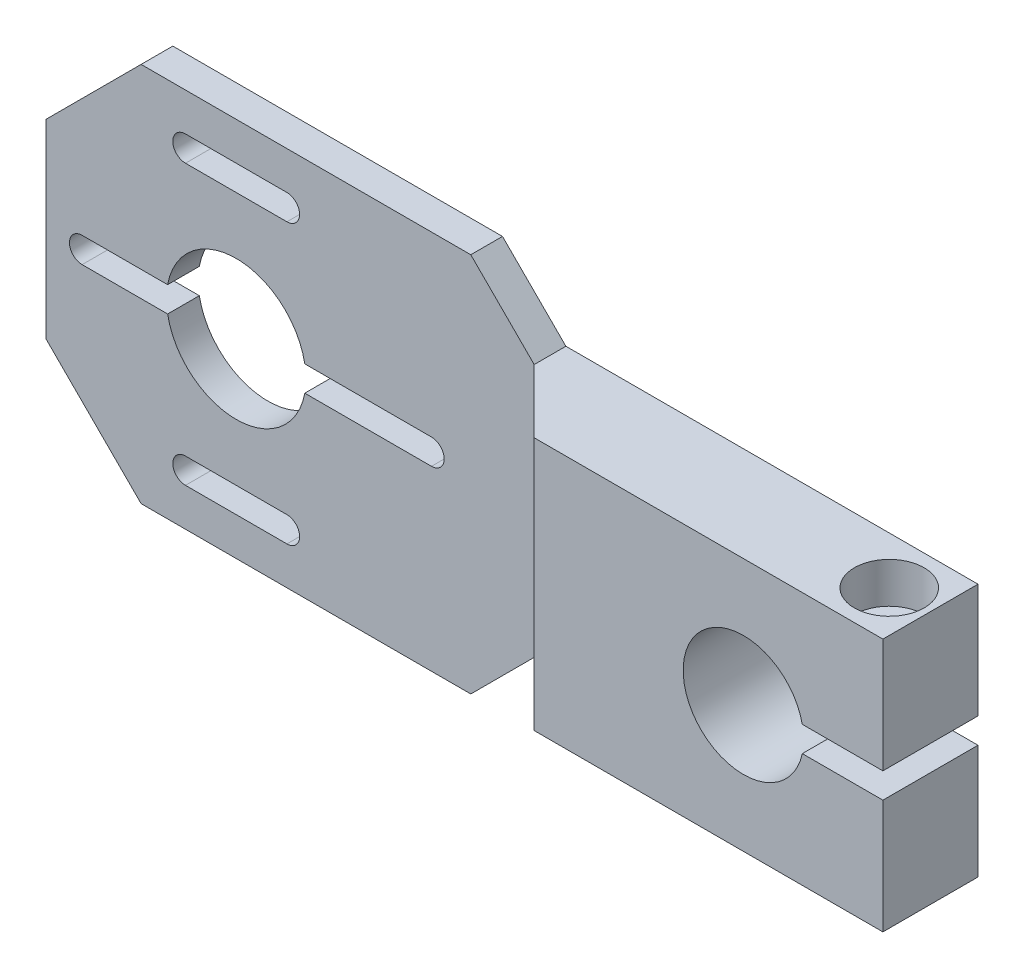
ISO-10303-21;
HEADER;
FILE_DESCRIPTION(('STEP AP214'),'2;1');
FILE_NAME('part.step','',(''),(''),'','','');
FILE_SCHEMA(('AUTOMOTIVE_DESIGN { 1 0 10303 214 1 1 1 1 }'));
ENDSEC;
DATA;
#1=APPLICATION_CONTEXT('core data for automotive mechanical design processes');
#2=APPLICATION_PROTOCOL_DEFINITION('international standard','automotive_design',2000,#1);
#3=PRODUCT_CONTEXT('',#1,'mechanical');
#4=PRODUCT('Part','Part','',(#3));
#5=PRODUCT_RELATED_PRODUCT_CATEGORY('part','',(#4));
#6=PRODUCT_DEFINITION_FORMATION('','',#4);
#7=PRODUCT_DEFINITION_CONTEXT('part definition',#1,'design');
#8=PRODUCT_DEFINITION('design','',#6,#7);
#9=PRODUCT_DEFINITION_SHAPE('','',#8);
#10=(LENGTH_UNIT() NAMED_UNIT(*) SI_UNIT(.MILLI.,.METRE.));
#11=(NAMED_UNIT(*) PLANE_ANGLE_UNIT() SI_UNIT($,.RADIAN.));
#12=(NAMED_UNIT(*) SI_UNIT($,.STERADIAN.) SOLID_ANGLE_UNIT());
#13=UNCERTAINTY_MEASURE_WITH_UNIT(LENGTH_MEASURE(1.E-05),#10,'distance_accuracy_value','');
#14=(GEOMETRIC_REPRESENTATION_CONTEXT(3) GLOBAL_UNCERTAINTY_ASSIGNED_CONTEXT((#13)) GLOBAL_UNIT_ASSIGNED_CONTEXT((#10,
#11,#12)) REPRESENTATION_CONTEXT('',''));
#15=CARTESIAN_POINT('',(0.,0.,0.));
#16=DIRECTION('',(0.,0.,1.));
#17=DIRECTION('',(1.,0.,0.));
#18=AXIS2_PLACEMENT_3D('',#15,#16,#17);
#19=CARTESIAN_POINT('',(0.,0.,15.));
#20=DIRECTION('',(0.,0.,-1.));
#21=DIRECTION('',(-1.,0.,0.));
#22=AXIS2_PLACEMENT_3D('',#19,#20,#21);
#23=CYLINDRICAL_SURFACE('',#22,11.);
#24=DIRECTION('',(0.,0.,-1.));
#25=VECTOR('',#24,1.);
#26=CARTESIAN_POINT('',(10.816653826392,2.,15.));
#27=LINE('',#26,#25);
#28=CARTESIAN_POINT('',(10.816653826392,2.,4.99999999999999));
#29=VERTEX_POINT('',#28);
#30=CARTESIAN_POINT('',(10.816653826392,2.,0.));
#31=VERTEX_POINT('',#30);
#32=EDGE_CURVE('E280',#29,#31,#27,.T.);
#33=ORIENTED_EDGE('',*,*,#32,.F.);
#34=CARTESIAN_POINT('',(0.,0.,4.99999999999999));
#35=DIRECTION('',(0.,0.,1.));
#36=DIRECTION('',(1.,0.,0.));
#37=AXIS2_PLACEMENT_3D('',#34,#35,#36);
#38=CIRCLE('',#37,11.);
#39=CARTESIAN_POINT('',(-10.816653826392,2.,4.99999999999999));
#40=VERTEX_POINT('',#39);
#41=EDGE_CURVE('E334',#29,#40,#38,.T.);
#42=ORIENTED_EDGE('',*,*,#41,.T.);
#43=DIRECTION('',(0.,0.,-1.));
#44=VECTOR('',#43,1.);
#45=CARTESIAN_POINT('',(-10.816653826392,2.,15.));
#46=LINE('',#45,#44);
#47=CARTESIAN_POINT('',(-10.816653826392,2.,0.));
#48=VERTEX_POINT('',#47);
#49=EDGE_CURVE('E299',#48,#40,#46,.F.);
#50=ORIENTED_EDGE('',*,*,#49,.F.);
#51=CARTESIAN_POINT('',(0.,0.,0.));
#52=DIRECTION('',(0.,0.,1.));
#53=DIRECTION('',(1.,0.,0.));
#54=AXIS2_PLACEMENT_3D('',#51,#52,#53);
#55=CIRCLE('',#54,11.);
#56=EDGE_CURVE('E405',#31,#48,#55,.T.);
#57=ORIENTED_EDGE('',*,*,#56,.F.);
#58=EDGE_LOOP('',(#33,#42,#50,#57));
#59=FACE_BOUND('',#58,.T.);
#60=ADVANCED_FACE('F46',(#59),#23,.F.);
#61=CARTESIAN_POINT('',(90.,0.,15.));
#62=DIRECTION('',(0.,0.,1.));
#63=DIRECTION('',(1.,0.,0.));
#64=AXIS2_PLACEMENT_3D('',#61,#62,#63);
#65=PLANE('',#64);
#66=DIRECTION('',(-1.,0.,0.));
#67=VECTOR('',#66,1.);
#68=CARTESIAN_POINT('',(112.,20.,15.));
#69=LINE('',#68,#67);
#70=CARTESIAN_POINT('',(112.,20.,15.));
#71=VERTEX_POINT('',#70);
#72=CARTESIAN_POINT('',(57.,20.,15.));
#73=VERTEX_POINT('',#72);
#74=EDGE_CURVE('E421',#71,#73,#69,.T.);
#75=ORIENTED_EDGE('',*,*,#74,.T.);
#76=DIRECTION('',(0.,-1.,0.));
#77=VECTOR('',#76,1.);
#78=CARTESIAN_POINT('',(57.,0.,15.));
#79=LINE('',#78,#77);
#80=CARTESIAN_POINT('',(57.,-20.,15.));
#81=VERTEX_POINT('',#80);
#82=EDGE_CURVE('E348',#73,#81,#79,.T.);
#83=ORIENTED_EDGE('',*,*,#82,.T.);
#84=DIRECTION('',(1.,0.,0.));
#85=VECTOR('',#84,1.);
#86=CARTESIAN_POINT('',(112.,-20.,15.));
#87=LINE('',#86,#85);
#88=CARTESIAN_POINT('',(112.,-20.,15.));
#89=VERTEX_POINT('',#88);
#90=EDGE_CURVE('E408',#81,#89,#87,.T.);
#91=ORIENTED_EDGE('',*,*,#90,.T.);
#92=DIRECTION('',(0.,1.,0.));
#93=VECTOR('',#92,1.);
#94=CARTESIAN_POINT('',(112.,-20.,15.));
#95=LINE('',#94,#93);
#96=CARTESIAN_POINT('',(112.,-2.,15.));
#97=VERTEX_POINT('',#96);
#98=EDGE_CURVE('E410',#89,#97,#95,.T.);
#99=ORIENTED_EDGE('',*,*,#98,.T.);
#100=DIRECTION('',(-1.,0.,0.));
#101=VECTOR('',#100,1.);
#102=CARTESIAN_POINT('',(112.,-2.,15.));
#103=LINE('',#102,#101);
#104=CARTESIAN_POINT('',(99.2870878105034,-2.,15.));
#105=VERTEX_POINT('',#104);
#106=EDGE_CURVE('E413',#97,#105,#103,.T.);
#107=ORIENTED_EDGE('',*,*,#106,.T.);
#108=CARTESIAN_POINT('',(90.,0.,15.));
#109=DIRECTION('',(0.,0.,-1.));
#110=DIRECTION('',(1.,0.,0.));
#111=AXIS2_PLACEMENT_3D('',#108,#109,#110);
#112=CIRCLE('',#111,9.5);
#113=CARTESIAN_POINT('',(99.2870878105034,2.,15.));
#114=VERTEX_POINT('',#113);
#115=EDGE_CURVE('E415',#105,#114,#112,.T.);
#116=ORIENTED_EDGE('',*,*,#115,.T.);
#117=DIRECTION('',(1.,0.,0.));
#118=VECTOR('',#117,1.);
#119=CARTESIAN_POINT('',(112.,2.,15.));
#120=LINE('',#119,#118);
#121=CARTESIAN_POINT('',(112.,2.,15.));
#122=VERTEX_POINT('',#121);
#123=EDGE_CURVE('E417',#114,#122,#120,.T.);
#124=ORIENTED_EDGE('',*,*,#123,.T.);
#125=DIRECTION('',(0.,1.,0.));
#126=VECTOR('',#125,1.);
#127=CARTESIAN_POINT('',(112.,20.,15.));
#128=LINE('',#127,#126);
#129=EDGE_CURVE('E419',#122,#71,#128,.T.);
#130=ORIENTED_EDGE('',*,*,#129,.T.);
#131=EDGE_LOOP('',(#75,#83,#91,#99,#107,#116,#124,#130));
#132=FACE_BOUND('',#131,.T.);
#133=ADVANCED_FACE('F535',(#132),#65,.T.);
#134=CARTESIAN_POINT('',(36.9999999999998,30.,15.));
#135=DIRECTION('',(0.,-1.,0.));
#136=DIRECTION('',(0.,0.,-1.));
#137=AXIS2_PLACEMENT_3D('',#134,#135,#136);
#138=PLANE('',#137);
#139=DIRECTION('',(-1.,0.,0.));
#140=VECTOR('',#139,1.);
#141=CARTESIAN_POINT('',(36.9999999999998,30.,4.99999999999999));
#142=LINE('',#141,#140);
#143=CARTESIAN_POINT('',(36.9999999999998,30.,4.99999999999999));
#144=VERTEX_POINT('',#143);
#145=CARTESIAN_POINT('',(-15.,30.,4.99999999999999));
#146=VERTEX_POINT('',#145);
#147=EDGE_CURVE('E340',#144,#146,#142,.T.);
#148=ORIENTED_EDGE('',*,*,#147,.F.);
#149=DIRECTION('',(0.,0.,-1.));
#150=VECTOR('',#149,1.);
#151=CARTESIAN_POINT('',(36.9999999999998,30.,15.));
#152=LINE('',#151,#150);
#153=CARTESIAN_POINT('',(36.9999999999998,30.,0.));
#154=VERTEX_POINT('',#153);
#155=EDGE_CURVE('E424',#144,#154,#152,.T.);
#156=ORIENTED_EDGE('',*,*,#155,.T.);
#157=DIRECTION('',(-1.,0.,0.));
#158=VECTOR('',#157,1.);
#159=CARTESIAN_POINT('',(36.9999999999998,30.,0.));
#160=LINE('',#159,#158);
#161=CARTESIAN_POINT('',(-15.,30.,0.));
#162=VERTEX_POINT('',#161);
#163=EDGE_CURVE('E407',#154,#162,#160,.T.);
#164=ORIENTED_EDGE('',*,*,#163,.T.);
#165=DIRECTION('',(0.,0.,-1.));
#166=VECTOR('',#165,1.);
#167=CARTESIAN_POINT('',(-15.,30.,15.));
#168=LINE('',#167,#166);
#169=EDGE_CURVE('E490',#146,#162,#168,.T.);
#170=ORIENTED_EDGE('',*,*,#169,.F.);
#171=EDGE_LOOP('',(#148,#156,#164,#170));
#172=FACE_BOUND('',#171,.T.);
#173=ADVANCED_FACE('F48',(#172),#138,.F.);
#174=CARTESIAN_POINT('',(-15.,30.,15.));
#175=DIRECTION('',(0.707106781186547,-0.707106781186548,0.));
#176=DIRECTION('',(0.707106781186548,0.707106781186547,0.));
#177=AXIS2_PLACEMENT_3D('',#174,#175,#176);
#178=PLANE('',#177);
#179=DIRECTION('',(-0.707106781186548,-0.707106781186547,0.));
#180=VECTOR('',#179,1.);
#181=CARTESIAN_POINT('',(-15.,30.,4.99999999999999));
#182=LINE('',#181,#180);
#183=CARTESIAN_POINT('',(-30.,15.,5.));
#184=VERTEX_POINT('',#183);
#185=EDGE_CURVE('E342',#146,#184,#182,.T.);
#186=ORIENTED_EDGE('',*,*,#185,.F.);
#187=ORIENTED_EDGE('',*,*,#169,.T.);
#188=DIRECTION('',(-0.707106781186548,-0.707106781186547,0.));
#189=VECTOR('',#188,1.);
#190=CARTESIAN_POINT('',(-15.,30.,0.));
#191=LINE('',#190,#189);
#192=CARTESIAN_POINT('',(-30.,15.,0.));
#193=VERTEX_POINT('',#192);
#194=EDGE_CURVE('E427',#162,#193,#191,.T.);
#195=ORIENTED_EDGE('',*,*,#194,.T.);
#196=DIRECTION('',(0.,0.,-1.));
#197=VECTOR('',#196,1.);
#198=CARTESIAN_POINT('',(-30.,15.,15.));
#199=LINE('',#198,#197);
#200=EDGE_CURVE('E488',#184,#193,#199,.T.);
#201=ORIENTED_EDGE('',*,*,#200,.F.);
#202=EDGE_LOOP('',(#186,#187,#195,#201));
#203=FACE_BOUND('',#202,.T.);
#204=ADVANCED_FACE('F690',(#203),#178,.F.);
#205=CARTESIAN_POINT('',(-30.,15.,15.));
#206=DIRECTION('',(1.,0.,0.));
#207=DIRECTION('',(0.,1.,0.));
#208=AXIS2_PLACEMENT_3D('',#205,#206,#207);
#209=PLANE('',#208);
#210=DIRECTION('',(0.,1.,0.));
#211=VECTOR('',#210,1.);
#212=CARTESIAN_POINT('',(-30.,-30.0000000000001,5.));
#213=LINE('',#212,#211);
#214=CARTESIAN_POINT('',(-30.,-15.,4.99999999999999));
#215=VERTEX_POINT('',#214);
#216=EDGE_CURVE('E309',#215,#184,#213,.T.);
#217=ORIENTED_EDGE('',*,*,#216,.T.);
#218=ORIENTED_EDGE('',*,*,#200,.T.);
#219=DIRECTION('',(0.,-1.,0.));
#220=VECTOR('',#219,1.);
#221=CARTESIAN_POINT('',(-30.,15.,0.));
#222=LINE('',#221,#220);
#223=CARTESIAN_POINT('',(-30.,-15.,0.));
#224=VERTEX_POINT('',#223);
#225=EDGE_CURVE('E430',#193,#224,#222,.T.);
#226=ORIENTED_EDGE('',*,*,#225,.T.);
#227=DIRECTION('',(0.,0.,-1.));
#228=VECTOR('',#227,1.);
#229=CARTESIAN_POINT('',(-30.,-15.,15.));
#230=LINE('',#229,#228);
#231=EDGE_CURVE('E486',#215,#224,#230,.T.);
#232=ORIENTED_EDGE('',*,*,#231,.F.);
#233=EDGE_LOOP('',(#217,#218,#226,#232));
#234=FACE_BOUND('',#233,.T.);
#235=ADVANCED_FACE('F686',(#234),#209,.F.);
#236=CARTESIAN_POINT('',(-30.,-15.,15.));
#237=DIRECTION('',(0.707106781186547,0.707106781186548,0.));
#238=DIRECTION('',(-0.707106781186548,0.707106781186547,0.));
#239=AXIS2_PLACEMENT_3D('',#236,#237,#238);
#240=PLANE('',#239);
#241=DIRECTION('',(0.707106781186548,-0.707106781186547,0.));
#242=VECTOR('',#241,1.);
#243=CARTESIAN_POINT('',(-30.,-15.,4.99999999999999));
#244=LINE('',#243,#242);
#245=CARTESIAN_POINT('',(-15.,-30.,4.99999999999999));
#246=VERTEX_POINT('',#245);
#247=EDGE_CURVE('E346',#215,#246,#244,.T.);
#248=ORIENTED_EDGE('',*,*,#247,.F.);
#249=ORIENTED_EDGE('',*,*,#231,.T.);
#250=DIRECTION('',(0.707106781186548,-0.707106781186547,0.));
#251=VECTOR('',#250,1.);
#252=CARTESIAN_POINT('',(-30.,-15.,0.));
#253=LINE('',#252,#251);
#254=CARTESIAN_POINT('',(-15.,-30.,0.));
#255=VERTEX_POINT('',#254);
#256=EDGE_CURVE('E433',#224,#255,#253,.T.);
#257=ORIENTED_EDGE('',*,*,#256,.T.);
#258=DIRECTION('',(0.,0.,-1.));
#259=VECTOR('',#258,1.);
#260=CARTESIAN_POINT('',(-15.,-30.,15.));
#261=LINE('',#260,#259);
#262=EDGE_CURVE('E484',#246,#255,#261,.T.);
#263=ORIENTED_EDGE('',*,*,#262,.F.);
#264=EDGE_LOOP('',(#248,#249,#257,#263));
#265=FACE_BOUND('',#264,.T.);
#266=ADVANCED_FACE('F683',(#265),#240,.F.);
#267=CARTESIAN_POINT('',(-15.,-30.,15.));
#268=DIRECTION('',(0.,1.,0.));
#269=DIRECTION('',(-1.,0.,0.));
#270=AXIS2_PLACEMENT_3D('',#267,#268,#269);
#271=PLANE('',#270);
#272=DIRECTION('',(1.,0.,0.));
#273=VECTOR('',#272,1.);
#274=CARTESIAN_POINT('',(0.,-30.,4.99999999999999));
#275=LINE('',#274,#273);
#276=CARTESIAN_POINT('',(36.9999999999998,-30.,4.99999999999999));
#277=VERTEX_POINT('',#276);
#278=EDGE_CURVE('E306',#246,#277,#275,.T.);
#279=ORIENTED_EDGE('',*,*,#278,.F.);
#280=ORIENTED_EDGE('',*,*,#262,.T.);
#281=DIRECTION('',(1.,0.,0.));
#282=VECTOR('',#281,1.);
#283=CARTESIAN_POINT('',(-15.,-30.,0.));
#284=LINE('',#283,#282);
#285=CARTESIAN_POINT('',(36.9999999999998,-30.,0.));
#286=VERTEX_POINT('',#285);
#287=EDGE_CURVE('E436',#255,#286,#284,.T.);
#288=ORIENTED_EDGE('',*,*,#287,.T.);
#289=DIRECTION('',(0.,0.,-1.));
#290=VECTOR('',#289,1.);
#291=CARTESIAN_POINT('',(36.9999999999998,-30.,15.));
#292=LINE('',#291,#290);
#293=EDGE_CURVE('E482',#277,#286,#292,.T.);
#294=ORIENTED_EDGE('',*,*,#293,.F.);
#295=EDGE_LOOP('',(#279,#280,#288,#294));
#296=FACE_BOUND('',#295,.T.);
#297=ADVANCED_FACE('F679',(#296),#271,.F.);
#298=CARTESIAN_POINT('',(36.9999999999998,-30.,15.));
#299=DIRECTION('',(-0.707106781186543,0.707106781186552,0.));
#300=DIRECTION('',(-0.707106781186552,-0.707106781186543,0.));
#301=AXIS2_PLACEMENT_3D('',#298,#299,#300);
#302=PLANE('',#301);
#303=DIRECTION('',(0.707106781186552,0.707106781186543,0.));
#304=VECTOR('',#303,1.);
#305=CARTESIAN_POINT('',(36.9999999999998,-30.,4.99999999999999));
#306=LINE('',#305,#304);
#307=CARTESIAN_POINT('',(47.,-20.,4.99999999999999));
#308=VERTEX_POINT('',#307);
#309=EDGE_CURVE('E344',#277,#308,#306,.T.);
#310=ORIENTED_EDGE('',*,*,#309,.F.);
#311=ORIENTED_EDGE('',*,*,#293,.T.);
#312=DIRECTION('',(0.707106781186552,0.707106781186543,0.));
#313=VECTOR('',#312,1.);
#314=CARTESIAN_POINT('',(36.9999999999998,-30.,0.));
#315=LINE('',#314,#313);
#316=CARTESIAN_POINT('',(47.,-20.,0.));
#317=VERTEX_POINT('',#316);
#318=EDGE_CURVE('E439',#286,#317,#315,.T.);
#319=ORIENTED_EDGE('',*,*,#318,.T.);
#320=DIRECTION('',(0.,0.,-1.));
#321=VECTOR('',#320,1.);
#322=CARTESIAN_POINT('',(47.,-20.,15.));
#323=LINE('',#322,#321);
#324=EDGE_CURVE('E480',#308,#317,#323,.T.);
#325=ORIENTED_EDGE('',*,*,#324,.F.);
#326=EDGE_LOOP('',(#310,#311,#319,#325));
#327=FACE_BOUND('',#326,.T.);
#328=ADVANCED_FACE('F675',(#327),#302,.F.);
#329=CARTESIAN_POINT('',(112.,-20.,15.));
#330=DIRECTION('',(0.,1.,0.));
#331=DIRECTION('',(-1.,0.,0.));
#332=AXIS2_PLACEMENT_3D('',#329,#330,#331);
#333=PLANE('',#332);
#334=CARTESIAN_POINT('',(105.5,-20.,7.5));
#335=DIRECTION('',(0.,1.,0.));
#336=DIRECTION('',(-1.,0.,0.));
#337=AXIS2_PLACEMENT_3D('',#334,#335,#336);
#338=CIRCLE('',#337,2.5);
#339=CARTESIAN_POINT('',(103.,-20.,7.5));
#340=VERTEX_POINT('',#339);
#341=EDGE_CURVE('E305',#340,#340,#338,.T.);
#342=ORIENTED_EDGE('',*,*,#341,.T.);
#343=EDGE_LOOP('',(#342));
#344=FACE_BOUND('',#343,.T.);
#345=DIRECTION('',(0.707106781186546,0.,0.707106781186549));
#346=VECTOR('',#345,1.);
#347=CARTESIAN_POINT('',(84.4999999999999,-20.,42.5));
#348=LINE('',#347,#346);
#349=EDGE_CURVE('E351',#308,#81,#348,.T.);
#350=ORIENTED_EDGE('',*,*,#349,.F.);
#351=ORIENTED_EDGE('',*,*,#324,.T.);
#352=DIRECTION('',(1.,0.,0.));
#353=VECTOR('',#352,1.);
#354=CARTESIAN_POINT('',(112.,-20.,0.));
#355=LINE('',#354,#353);
#356=CARTESIAN_POINT('',(112.,-20.,0.));
#357=VERTEX_POINT('',#356);
#358=EDGE_CURVE('E442',#317,#357,#355,.T.);
#359=ORIENTED_EDGE('',*,*,#358,.T.);
#360=DIRECTION('',(0.,0.,-1.));
#361=VECTOR('',#360,1.);
#362=CARTESIAN_POINT('',(112.,-20.,15.));
#363=LINE('',#362,#361);
#364=EDGE_CURVE('E477',#89,#357,#363,.T.);
#365=ORIENTED_EDGE('',*,*,#364,.F.);
#366=ORIENTED_EDGE('',*,*,#90,.F.);
#367=EDGE_LOOP('',(#350,#351,#359,#365,#366));
#368=FACE_BOUND('',#367,.T.);
#369=ADVANCED_FACE('F668',(#344,#368),#333,.F.);
#370=CARTESIAN_POINT('',(112.,20.,15.));
#371=DIRECTION('',(0.,-1.,0.));
#372=DIRECTION('',(1.,0.,0.));
#373=AXIS2_PLACEMENT_3D('',#370,#371,#372);
#374=PLANE('',#373);
#375=CARTESIAN_POINT('',(105.5,20.,7.5));
#376=DIRECTION('',(0.,1.,0.));
#377=DIRECTION('',(0.,0.,1.));
#378=AXIS2_PLACEMENT_3D('',#375,#376,#377);
#379=CIRCLE('',#378,5.49999999999999);
#380=CARTESIAN_POINT('',(105.5,20.,13.));
#381=VERTEX_POINT('',#380);
#382=EDGE_CURVE('E353',#381,#381,#379,.T.);
#383=ORIENTED_EDGE('',*,*,#382,.F.);
#384=EDGE_LOOP('',(#383));
#385=FACE_BOUND('',#384,.T.);
#386=DIRECTION('',(-0.707106781186546,0.,-0.707106781186549));
#387=VECTOR('',#386,1.);
#388=CARTESIAN_POINT('',(84.4999999999999,20.,42.5));
#389=LINE('',#388,#387);
#390=CARTESIAN_POINT('',(47.,20.,4.99999999999998));
#391=VERTEX_POINT('',#390);
#392=EDGE_CURVE('E495',#73,#391,#389,.T.);
#393=ORIENTED_EDGE('',*,*,#392,.F.);
#394=ORIENTED_EDGE('',*,*,#74,.F.);
#395=DIRECTION('',(0.,0.,-1.));
#396=VECTOR('',#395,1.);
#397=CARTESIAN_POINT('',(112.,20.,15.));
#398=LINE('',#397,#396);
#399=CARTESIAN_POINT('',(112.,20.,0.));
#400=VERTEX_POINT('',#399);
#401=EDGE_CURVE('E462',#71,#400,#398,.T.);
#402=ORIENTED_EDGE('',*,*,#401,.T.);
#403=DIRECTION('',(-1.,0.,0.));
#404=VECTOR('',#403,1.);
#405=CARTESIAN_POINT('',(112.,20.,0.));
#406=LINE('',#405,#404);
#407=CARTESIAN_POINT('',(47.,20.,0.));
#408=VERTEX_POINT('',#407);
#409=EDGE_CURVE('E454',#400,#408,#406,.T.);
#410=ORIENTED_EDGE('',*,*,#409,.T.);
#411=DIRECTION('',(0.,0.,-1.));
#412=VECTOR('',#411,1.);
#413=CARTESIAN_POINT('',(47.,20.,15.));
#414=LINE('',#413,#412);
#415=EDGE_CURVE('E460',#391,#408,#414,.T.);
#416=ORIENTED_EDGE('',*,*,#415,.F.);
#417=EDGE_LOOP('',(#393,#394,#402,#410,#416));
#418=FACE_BOUND('',#417,.T.);
#419=ADVANCED_FACE('F530',(#385,#418),#374,.F.);
#420=CARTESIAN_POINT('',(36.9999999999998,30.,15.));
#421=DIRECTION('',(-0.707106781186543,-0.707106781186552,0.));
#422=DIRECTION('',(0.707106781186552,-0.707106781186543,0.));
#423=AXIS2_PLACEMENT_3D('',#420,#421,#422);
#424=PLANE('',#423);
#425=DIRECTION('',(-0.707106781186552,0.707106781186543,0.));
#426=VECTOR('',#425,1.);
#427=CARTESIAN_POINT('',(36.9999999999998,30.,4.99999999999999));
#428=LINE('',#427,#426);
#429=EDGE_CURVE('E338',#391,#144,#428,.T.);
#430=ORIENTED_EDGE('',*,*,#429,.F.);
#431=ORIENTED_EDGE('',*,*,#415,.T.);
#432=DIRECTION('',(-0.707106781186552,0.707106781186543,0.));
#433=VECTOR('',#432,1.);
#434=CARTESIAN_POINT('',(36.9999999999998,30.,0.));
#435=LINE('',#434,#433);
#436=EDGE_CURVE('E411',#408,#154,#435,.T.);
#437=ORIENTED_EDGE('',*,*,#436,.T.);
#438=ORIENTED_EDGE('',*,*,#155,.F.);
#439=EDGE_LOOP('',(#430,#431,#437,#438));
#440=FACE_BOUND('',#439,.T.);
#441=ADVANCED_FACE('F521',(#440),#424,.F.);
#442=DIRECTION('',(0.,0.,-1.));
#443=VECTOR('',#442,1.);
#444=CARTESIAN_POINT('',(10.816653826392,-2.,15.));
#445=LINE('',#444,#443);
#446=CARTESIAN_POINT('',(10.816653826392,-2.,0.));
#447=VERTEX_POINT('',#446);
#448=CARTESIAN_POINT('',(10.816653826392,-2.,4.99999999999999));
#449=VERTEX_POINT('',#448);
#450=EDGE_CURVE('E60',#447,#449,#445,.F.);
#451=ORIENTED_EDGE('',*,*,#450,.F.);
#452=CARTESIAN_POINT('',(-10.816653826392,-2.,0.));
#453=VERTEX_POINT('',#452);
#454=EDGE_CURVE('E270',#453,#447,#55,.T.);
#455=ORIENTED_EDGE('',*,*,#454,.F.);
#456=DIRECTION('',(0.,0.,-1.));
#457=VECTOR('',#456,1.);
#458=CARTESIAN_POINT('',(-10.816653826392,-2.,15.));
#459=LINE('',#458,#457);
#460=CARTESIAN_POINT('',(-10.816653826392,-2.,4.99999999999999));
#461=VERTEX_POINT('',#460);
#462=EDGE_CURVE('E296',#461,#453,#459,.T.);
#463=ORIENTED_EDGE('',*,*,#462,.F.);
#464=EDGE_CURVE('E335',#461,#449,#38,.T.);
#465=ORIENTED_EDGE('',*,*,#464,.T.);
#466=EDGE_LOOP('',(#451,#455,#463,#465));
#467=FACE_BOUND('',#466,.T.);
#468=ADVANCED_FACE('F518',(#467),#23,.F.);
#469=CARTESIAN_POINT('',(-8.,22.,15.));
#470=DIRECTION('',(0.,0.,-1.));
#471=DIRECTION('',(-1.,0.,0.));
#472=AXIS2_PLACEMENT_3D('',#469,#470,#471);
#473=CYLINDRICAL_SURFACE('',#472,2.);
#474=DIRECTION('',(0.,0.,-1.));
#475=VECTOR('',#474,1.);
#476=CARTESIAN_POINT('',(-8.,24.,15.));
#477=LINE('',#476,#475);
#478=CARTESIAN_POINT('',(-8.,24.,4.99999999999999));
#479=VERTEX_POINT('',#478);
#480=CARTESIAN_POINT('',(-7.99999999999999,24.,0.));
#481=VERTEX_POINT('',#480);
#482=EDGE_CURVE('E397',#479,#481,#477,.T.);
#483=ORIENTED_EDGE('',*,*,#482,.F.);
#484=CARTESIAN_POINT('',(-8.,22.,4.99999999999999));
#485=DIRECTION('',(0.,0.,1.));
#486=DIRECTION('',(1.,0.,0.));
#487=AXIS2_PLACEMENT_3D('',#484,#485,#486);
#488=CIRCLE('',#487,2.);
#489=CARTESIAN_POINT('',(-8.,20.,4.99999999999999));
#490=VERTEX_POINT('',#489);
#491=EDGE_CURVE('E331',#479,#490,#488,.T.);
#492=ORIENTED_EDGE('',*,*,#491,.T.);
#493=DIRECTION('',(0.,0.,-1.));
#494=VECTOR('',#493,1.);
#495=CARTESIAN_POINT('',(-8.,20.,15.));
#496=LINE('',#495,#494);
#497=CARTESIAN_POINT('',(-8.,20.,0.));
#498=VERTEX_POINT('',#497);
#499=EDGE_CURVE('E403',#490,#498,#496,.T.);
#500=ORIENTED_EDGE('',*,*,#499,.T.);
#501=CARTESIAN_POINT('',(-8.,22.,0.));
#502=DIRECTION('',(0.,0.,1.));
#503=DIRECTION('',(1.,0.,0.));
#504=AXIS2_PLACEMENT_3D('',#501,#502,#503);
#505=CIRCLE('',#504,2.);
#506=EDGE_CURVE('E385',#481,#498,#505,.T.);
#507=ORIENTED_EDGE('',*,*,#506,.F.);
#508=EDGE_LOOP('',(#483,#492,#500,#507));
#509=FACE_BOUND('',#508,.T.);
#510=ADVANCED_FACE('F520',(#509),#473,.F.);
#511=CARTESIAN_POINT('',(-8.,20.,15.));
#512=DIRECTION('',(0.,1.,0.));
#513=DIRECTION('',(0.,0.,1.));
#514=AXIS2_PLACEMENT_3D('',#511,#512,#513);
#515=PLANE('',#514);
#516=ORIENTED_EDGE('',*,*,#499,.F.);
#517=DIRECTION('',(1.,0.,0.));
#518=VECTOR('',#517,1.);
#519=CARTESIAN_POINT('',(-8.,20.,4.99999999999999));
#520=LINE('',#519,#518);
#521=CARTESIAN_POINT('',(8.,20.,4.99999999999999));
#522=VERTEX_POINT('',#521);
#523=EDGE_CURVE('E328',#490,#522,#520,.T.);
#524=ORIENTED_EDGE('',*,*,#523,.T.);
#525=DIRECTION('',(0.,0.,-1.));
#526=VECTOR('',#525,1.);
#527=CARTESIAN_POINT('',(8.,20.,15.));
#528=LINE('',#527,#526);
#529=CARTESIAN_POINT('',(8.,20.,0.));
#530=VERTEX_POINT('',#529);
#531=EDGE_CURVE('E401',#522,#530,#528,.T.);
#532=ORIENTED_EDGE('',*,*,#531,.T.);
#533=DIRECTION('',(1.,0.,0.));
#534=VECTOR('',#533,1.);
#535=CARTESIAN_POINT('',(-8.,20.,0.));
#536=LINE('',#535,#534);
#537=EDGE_CURVE('E388',#498,#530,#536,.T.);
#538=ORIENTED_EDGE('',*,*,#537,.F.);
#539=EDGE_LOOP('',(#516,#524,#532,#538));
#540=FACE_BOUND('',#539,.T.);
#541=ADVANCED_FACE('F527',(#540),#515,.T.);
#542=CARTESIAN_POINT('',(8.,22.,15.));
#543=DIRECTION('',(0.,0.,-1.));
#544=DIRECTION('',(-1.,0.,0.));
#545=AXIS2_PLACEMENT_3D('',#542,#543,#544);
#546=CYLINDRICAL_SURFACE('',#545,2.);
#547=ORIENTED_EDGE('',*,*,#531,.F.);
#548=CARTESIAN_POINT('',(8.,22.,4.99999999999999));
#549=DIRECTION('',(0.,0.,1.));
#550=DIRECTION('',(1.,0.,0.));
#551=AXIS2_PLACEMENT_3D('',#548,#549,#550);
#552=CIRCLE('',#551,2.);
#553=CARTESIAN_POINT('',(8.,24.,4.99999999999999));
#554=VERTEX_POINT('',#553);
#555=EDGE_CURVE('E325',#522,#554,#552,.T.);
#556=ORIENTED_EDGE('',*,*,#555,.T.);
#557=DIRECTION('',(0.,0.,-1.));
#558=VECTOR('',#557,1.);
#559=CARTESIAN_POINT('',(8.,24.,15.));
#560=LINE('',#559,#558);
#561=CARTESIAN_POINT('',(8.,24.,0.));
#562=VERTEX_POINT('',#561);
#563=EDGE_CURVE('E399',#554,#562,#560,.T.);
#564=ORIENTED_EDGE('',*,*,#563,.T.);
#565=CARTESIAN_POINT('',(8.,22.,0.));
#566=DIRECTION('',(0.,0.,1.));
#567=DIRECTION('',(1.,0.,0.));
#568=AXIS2_PLACEMENT_3D('',#565,#566,#567);
#569=CIRCLE('',#568,2.);
#570=EDGE_CURVE('E391',#530,#562,#569,.T.);
#571=ORIENTED_EDGE('',*,*,#570,.F.);
#572=EDGE_LOOP('',(#547,#556,#564,#571));
#573=FACE_BOUND('',#572,.T.);
#574=ADVANCED_FACE('F602',(#573),#546,.F.);
#575=CARTESIAN_POINT('',(-8.,24.,15.));
#576=DIRECTION('',(0.,-1.,0.));
#577=DIRECTION('',(0.,0.,-1.));
#578=AXIS2_PLACEMENT_3D('',#575,#576,#577);
#579=PLANE('',#578);
#580=ORIENTED_EDGE('',*,*,#563,.F.);
#581=DIRECTION('',(-1.,0.,0.));
#582=VECTOR('',#581,1.);
#583=CARTESIAN_POINT('',(-8.,24.,4.99999999999999));
#584=LINE('',#583,#582);
#585=EDGE_CURVE('E322',#554,#479,#584,.T.);
#586=ORIENTED_EDGE('',*,*,#585,.T.);
#587=ORIENTED_EDGE('',*,*,#482,.T.);
#588=DIRECTION('',(-1.,0.,0.));
#589=VECTOR('',#588,1.);
#590=CARTESIAN_POINT('',(-8.,24.,0.));
#591=LINE('',#590,#589);
#592=EDGE_CURVE('E394',#562,#481,#591,.T.);
#593=ORIENTED_EDGE('',*,*,#592,.F.);
#594=EDGE_LOOP('',(#580,#586,#587,#593));
#595=FACE_BOUND('',#594,.T.);
#596=ADVANCED_FACE('F598',(#595),#579,.T.);
#597=CARTESIAN_POINT('',(-8.,-22.,15.));
#598=DIRECTION('',(0.,0.,-1.));
#599=DIRECTION('',(-1.,0.,0.));
#600=AXIS2_PLACEMENT_3D('',#597,#598,#599);
#601=CYLINDRICAL_SURFACE('',#600,2.);
#602=DIRECTION('',(0.,0.,-1.));
#603=VECTOR('',#602,1.);
#604=CARTESIAN_POINT('',(-8.,-20.,15.));
#605=LINE('',#604,#603);
#606=CARTESIAN_POINT('',(-8.,-20.,4.99999999999999));
#607=VERTEX_POINT('',#606);
#608=CARTESIAN_POINT('',(-7.99999999999999,-20.,0.));
#609=VERTEX_POINT('',#608);
#610=EDGE_CURVE('E377',#607,#609,#605,.T.);
#611=ORIENTED_EDGE('',*,*,#610,.F.);
#612=CARTESIAN_POINT('',(-8.,-22.,4.99999999999999));
#613=DIRECTION('',(0.,0.,1.));
#614=DIRECTION('',(1.,0.,0.));
#615=AXIS2_PLACEMENT_3D('',#612,#613,#614);
#616=CIRCLE('',#615,2.);
#617=CARTESIAN_POINT('',(-8.,-24.,4.99999999999999));
#618=VERTEX_POINT('',#617);
#619=EDGE_CURVE('E319',#607,#618,#616,.T.);
#620=ORIENTED_EDGE('',*,*,#619,.T.);
#621=DIRECTION('',(0.,0.,-1.));
#622=VECTOR('',#621,1.);
#623=CARTESIAN_POINT('',(-8.,-24.,15.));
#624=LINE('',#623,#622);
#625=CARTESIAN_POINT('',(-8.,-24.,0.));
#626=VERTEX_POINT('',#625);
#627=EDGE_CURVE('E383',#618,#626,#624,.T.);
#628=ORIENTED_EDGE('',*,*,#627,.T.);
#629=CARTESIAN_POINT('',(-8.,-22.,0.));
#630=DIRECTION('',(0.,0.,1.));
#631=DIRECTION('',(-1.,0.,0.));
#632=AXIS2_PLACEMENT_3D('',#629,#630,#631);
#633=CIRCLE('',#632,2.);
#634=EDGE_CURVE('E365',#609,#626,#633,.T.);
#635=ORIENTED_EDGE('',*,*,#634,.F.);
#636=EDGE_LOOP('',(#611,#620,#628,#635));
#637=FACE_BOUND('',#636,.T.);
#638=ADVANCED_FACE('F594',(#637),#601,.F.);
#639=CARTESIAN_POINT('',(-8.,-24.,15.));
#640=DIRECTION('',(0.,1.,0.));
#641=DIRECTION('',(0.,0.,1.));
#642=AXIS2_PLACEMENT_3D('',#639,#640,#641);
#643=PLANE('',#642);
#644=ORIENTED_EDGE('',*,*,#627,.F.);
#645=DIRECTION('',(1.,0.,0.));
#646=VECTOR('',#645,1.);
#647=CARTESIAN_POINT('',(-8.,-24.,4.99999999999999));
#648=LINE('',#647,#646);
#649=CARTESIAN_POINT('',(8.,-24.,4.99999999999999));
#650=VERTEX_POINT('',#649);
#651=EDGE_CURVE('E316',#618,#650,#648,.T.);
#652=ORIENTED_EDGE('',*,*,#651,.T.);
#653=DIRECTION('',(0.,0.,-1.));
#654=VECTOR('',#653,1.);
#655=CARTESIAN_POINT('',(8.,-24.,15.));
#656=LINE('',#655,#654);
#657=CARTESIAN_POINT('',(8.,-24.,0.));
#658=VERTEX_POINT('',#657);
#659=EDGE_CURVE('E381',#650,#658,#656,.T.);
#660=ORIENTED_EDGE('',*,*,#659,.T.);
#661=DIRECTION('',(1.,0.,0.));
#662=VECTOR('',#661,1.);
#663=CARTESIAN_POINT('',(-8.,-24.,0.));
#664=LINE('',#663,#662);
#665=EDGE_CURVE('E368',#626,#658,#664,.T.);
#666=ORIENTED_EDGE('',*,*,#665,.F.);
#667=EDGE_LOOP('',(#644,#652,#660,#666));
#668=FACE_BOUND('',#667,.T.);
#669=ADVANCED_FACE('F590',(#668),#643,.T.);
#670=CARTESIAN_POINT('',(8.,-22.,15.));
#671=DIRECTION('',(0.,0.,-1.));
#672=DIRECTION('',(-1.,0.,0.));
#673=AXIS2_PLACEMENT_3D('',#670,#671,#672);
#674=CYLINDRICAL_SURFACE('',#673,2.);
#675=ORIENTED_EDGE('',*,*,#659,.F.);
#676=CARTESIAN_POINT('',(8.,-22.,4.99999999999999));
#677=DIRECTION('',(0.,0.,1.));
#678=DIRECTION('',(1.,0.,0.));
#679=AXIS2_PLACEMENT_3D('',#676,#677,#678);
#680=CIRCLE('',#679,2.);
#681=CARTESIAN_POINT('',(8.,-20.,4.99999999999999));
#682=VERTEX_POINT('',#681);
#683=EDGE_CURVE('E312',#650,#682,#680,.T.);
#684=ORIENTED_EDGE('',*,*,#683,.T.);
#685=DIRECTION('',(0.,0.,-1.));
#686=VECTOR('',#685,1.);
#687=CARTESIAN_POINT('',(8.,-20.,15.));
#688=LINE('',#687,#686);
#689=CARTESIAN_POINT('',(8.,-20.,0.));
#690=VERTEX_POINT('',#689);
#691=EDGE_CURVE('E379',#682,#690,#688,.T.);
#692=ORIENTED_EDGE('',*,*,#691,.T.);
#693=CARTESIAN_POINT('',(8.,-22.,0.));
#694=DIRECTION('',(0.,0.,1.));
#695=DIRECTION('',(-1.,0.,0.));
#696=AXIS2_PLACEMENT_3D('',#693,#694,#695);
#697=CIRCLE('',#696,2.);
#698=EDGE_CURVE('E371',#658,#690,#697,.T.);
#699=ORIENTED_EDGE('',*,*,#698,.F.);
#700=EDGE_LOOP('',(#675,#684,#692,#699));
#701=FACE_BOUND('',#700,.T.);
#702=ADVANCED_FACE('F586',(#701),#674,.F.);
#703=CARTESIAN_POINT('',(-8.,-20.,15.));
#704=DIRECTION('',(0.,-1.,0.));
#705=DIRECTION('',(0.,0.,-1.));
#706=AXIS2_PLACEMENT_3D('',#703,#704,#705);
#707=PLANE('',#706);
#708=ORIENTED_EDGE('',*,*,#691,.F.);
#709=DIRECTION('',(-1.,0.,0.));
#710=VECTOR('',#709,1.);
#711=CARTESIAN_POINT('',(-8.,-20.,4.99999999999999));
#712=LINE('',#711,#710);
#713=EDGE_CURVE('E492',#682,#607,#712,.T.);
#714=ORIENTED_EDGE('',*,*,#713,.T.);
#715=ORIENTED_EDGE('',*,*,#610,.T.);
#716=DIRECTION('',(-1.,0.,0.));
#717=VECTOR('',#716,1.);
#718=CARTESIAN_POINT('',(-8.,-20.,0.));
#719=LINE('',#718,#717);
#720=EDGE_CURVE('E374',#690,#609,#719,.T.);
#721=ORIENTED_EDGE('',*,*,#720,.F.);
#722=EDGE_LOOP('',(#708,#714,#715,#721));
#723=FACE_BOUND('',#722,.T.);
#724=ADVANCED_FACE('F583',(#723),#707,.T.);
#725=CARTESIAN_POINT('',(90.,0.,0.));
#726=DIRECTION('',(0.,0.,1.));
#727=DIRECTION('',(1.,0.,0.));
#728=AXIS2_PLACEMENT_3D('',#725,#726,#727);
#729=PLANE('',#728);
#730=ORIENTED_EDGE('',*,*,#506,.T.);
#731=ORIENTED_EDGE('',*,*,#537,.T.);
#732=ORIENTED_EDGE('',*,*,#570,.T.);
#733=ORIENTED_EDGE('',*,*,#592,.T.);
#734=EDGE_LOOP('',(#730,#731,#732,#733));
#735=FACE_BOUND('',#734,.T.);
#736=ORIENTED_EDGE('',*,*,#163,.F.);
#737=ORIENTED_EDGE('',*,*,#436,.F.);
#738=ORIENTED_EDGE('',*,*,#409,.F.);
#739=DIRECTION('',(0.,1.,0.));
#740=VECTOR('',#739,1.);
#741=CARTESIAN_POINT('',(112.,20.,0.));
#742=LINE('',#741,#740);
#743=CARTESIAN_POINT('',(112.,2.,0.));
#744=VERTEX_POINT('',#743);
#745=EDGE_CURVE('E452',#744,#400,#742,.T.);
#746=ORIENTED_EDGE('',*,*,#745,.F.);
#747=DIRECTION('',(1.,0.,0.));
#748=VECTOR('',#747,1.);
#749=CARTESIAN_POINT('',(112.,2.,0.));
#750=LINE('',#749,#748);
#751=CARTESIAN_POINT('',(99.2870878105034,2.,0.));
#752=VERTEX_POINT('',#751);
#753=EDGE_CURVE('E450',#752,#744,#750,.T.);
#754=ORIENTED_EDGE('',*,*,#753,.F.);
#755=CARTESIAN_POINT('',(90.,0.,0.));
#756=DIRECTION('',(0.,0.,-1.));
#757=DIRECTION('',(1.,0.,0.));
#758=AXIS2_PLACEMENT_3D('',#755,#756,#757);
#759=CIRCLE('',#758,9.5);
#760=CARTESIAN_POINT('',(99.2870878105034,-2.,0.));
#761=VERTEX_POINT('',#760);
#762=EDGE_CURVE('E448',#761,#752,#759,.T.);
#763=ORIENTED_EDGE('',*,*,#762,.F.);
#764=DIRECTION('',(-1.,0.,0.));
#765=VECTOR('',#764,1.);
#766=CARTESIAN_POINT('',(112.,-2.,0.));
#767=LINE('',#766,#765);
#768=CARTESIAN_POINT('',(112.,-2.,0.));
#769=VERTEX_POINT('',#768);
#770=EDGE_CURVE('E446',#769,#761,#767,.T.);
#771=ORIENTED_EDGE('',*,*,#770,.F.);
#772=DIRECTION('',(0.,1.,0.));
#773=VECTOR('',#772,1.);
#774=CARTESIAN_POINT('',(112.,-20.,0.));
#775=LINE('',#774,#773);
#776=EDGE_CURVE('E444',#357,#769,#775,.T.);
#777=ORIENTED_EDGE('',*,*,#776,.F.);
#778=ORIENTED_EDGE('',*,*,#358,.F.);
#779=ORIENTED_EDGE('',*,*,#318,.F.);
#780=ORIENTED_EDGE('',*,*,#287,.F.);
#781=ORIENTED_EDGE('',*,*,#256,.F.);
#782=ORIENTED_EDGE('',*,*,#225,.F.);
#783=ORIENTED_EDGE('',*,*,#194,.F.);
#784=EDGE_LOOP('',(#736,#737,#738,#746,#754,#763,#771,#777,#778,#779,#780,#781,#782,#783));
#785=FACE_BOUND('',#784,.T.);
#786=CARTESIAN_POINT('',(30.8,0.,0.));
#787=DIRECTION('',(0.,0.,1.));
#788=DIRECTION('',(1.,0.,0.));
#789=AXIS2_PLACEMENT_3D('',#786,#787,#788);
#790=CIRCLE('',#789,2.);
#791=CARTESIAN_POINT('',(30.8,-2.,0.));
#792=VERTEX_POINT('',#791);
#793=CARTESIAN_POINT('',(30.8,2.,0.));
#794=VERTEX_POINT('',#793);
#795=EDGE_CURVE('E259',#792,#794,#790,.T.);
#796=ORIENTED_EDGE('',*,*,#795,.T.);
#797=DIRECTION('',(-1.,0.,0.));
#798=VECTOR('',#797,1.);
#799=CARTESIAN_POINT('',(8.8,2.,0.));
#800=LINE('',#799,#798);
#801=EDGE_CURVE('E256',#794,#31,#800,.T.);
#802=ORIENTED_EDGE('',*,*,#801,.T.);
#803=ORIENTED_EDGE('',*,*,#56,.T.);
#804=DIRECTION('',(-1.,0.,0.));
#805=VECTOR('',#804,1.);
#806=CARTESIAN_POINT('',(-24.3,2.,0.));
#807=LINE('',#806,#805);
#808=CARTESIAN_POINT('',(-24.3,2.,0.));
#809=VERTEX_POINT('',#808);
#810=EDGE_CURVE('E288',#48,#809,#807,.T.);
#811=ORIENTED_EDGE('',*,*,#810,.T.);
#812=CARTESIAN_POINT('',(-24.3,0.,0.));
#813=DIRECTION('',(0.,0.,1.));
#814=DIRECTION('',(1.,0.,0.));
#815=AXIS2_PLACEMENT_3D('',#812,#813,#814);
#816=CIRCLE('',#815,2.);
#817=CARTESIAN_POINT('',(-24.3,-2.,0.));
#818=VERTEX_POINT('',#817);
#819=EDGE_CURVE('E282',#809,#818,#816,.T.);
#820=ORIENTED_EDGE('',*,*,#819,.T.);
#821=DIRECTION('',(1.,0.,0.));
#822=VECTOR('',#821,1.);
#823=CARTESIAN_POINT('',(-24.3,-2.,0.));
#824=LINE('',#823,#822);
#825=EDGE_CURVE('E285',#818,#453,#824,.T.);
#826=ORIENTED_EDGE('',*,*,#825,.T.);
#827=ORIENTED_EDGE('',*,*,#454,.T.);
#828=DIRECTION('',(1.,0.,0.));
#829=VECTOR('',#828,1.);
#830=CARTESIAN_POINT('',(8.8,-2.,0.));
#831=LINE('',#830,#829);
#832=EDGE_CURVE('E251',#447,#792,#831,.T.);
#833=ORIENTED_EDGE('',*,*,#832,.T.);
#834=EDGE_LOOP('',(#796,#802,#803,#811,#820,#826,#827,#833));
#835=FACE_BOUND('',#834,.T.);
#836=ORIENTED_EDGE('',*,*,#634,.T.);
#837=ORIENTED_EDGE('',*,*,#665,.T.);
#838=ORIENTED_EDGE('',*,*,#698,.T.);
#839=ORIENTED_EDGE('',*,*,#720,.T.);
#840=EDGE_LOOP('',(#836,#837,#838,#839));
#841=FACE_BOUND('',#840,.T.);
#842=ADVANCED_FACE('F266',(#735,#785,#835,#841),#729,.F.);
#843=CARTESIAN_POINT('',(112.,-20.,15.));
#844=DIRECTION('',(-1.,0.,0.));
#845=DIRECTION('',(0.,0.,1.));
#846=AXIS2_PLACEMENT_3D('',#843,#844,#845);
#847=PLANE('',#846);
#848=ORIENTED_EDGE('',*,*,#776,.T.);
#849=DIRECTION('',(0.,0.,-1.));
#850=VECTOR('',#849,1.);
#851=CARTESIAN_POINT('',(112.,-2.,15.));
#852=LINE('',#851,#850);
#853=EDGE_CURVE('E474',#97,#769,#852,.T.);
#854=ORIENTED_EDGE('',*,*,#853,.F.);
#855=ORIENTED_EDGE('',*,*,#98,.F.);
#856=ORIENTED_EDGE('',*,*,#364,.T.);
#857=EDGE_LOOP('',(#848,#854,#855,#856));
#858=FACE_BOUND('',#857,.T.);
#859=ADVANCED_FACE('F624',(#858),#847,.F.);
#860=CARTESIAN_POINT('',(112.,-2.,15.));
#861=DIRECTION('',(0.,-1.,0.));
#862=DIRECTION('',(1.,0.,0.));
#863=AXIS2_PLACEMENT_3D('',#860,#861,#862);
#864=PLANE('',#863);
#865=CARTESIAN_POINT('',(105.5,-2.,7.5));
#866=DIRECTION('',(0.,1.,0.));
#867=DIRECTION('',(0.,0.,1.));
#868=AXIS2_PLACEMENT_3D('',#865,#866,#867);
#869=CIRCLE('',#868,2.5);
#870=CARTESIAN_POINT('',(105.5,-2.,10.));
#871=VERTEX_POINT('',#870);
#872=EDGE_CURVE('E302',#871,#871,#869,.T.);
#873=ORIENTED_EDGE('',*,*,#872,.F.);
#874=EDGE_LOOP('',(#873));
#875=FACE_BOUND('',#874,.T.);
#876=ORIENTED_EDGE('',*,*,#770,.T.);
#877=DIRECTION('',(0.,0.,-1.));
#878=VECTOR('',#877,1.);
#879=CARTESIAN_POINT('',(99.2870878105034,-2.,15.));
#880=LINE('',#879,#878);
#881=EDGE_CURVE('E471',#105,#761,#880,.T.);
#882=ORIENTED_EDGE('',*,*,#881,.F.);
#883=ORIENTED_EDGE('',*,*,#106,.F.);
#884=ORIENTED_EDGE('',*,*,#853,.T.);
#885=EDGE_LOOP('',(#876,#882,#883,#884));
#886=FACE_BOUND('',#885,.T.);
#887=ADVANCED_FACE('F659',(#875,#886),#864,.F.);
#888=CARTESIAN_POINT('',(90.,0.,15.));
#889=DIRECTION('',(0.,0.,-1.));
#890=DIRECTION('',(-1.,0.,0.));
#891=AXIS2_PLACEMENT_3D('',#888,#889,#890);
#892=CYLINDRICAL_SURFACE('',#891,9.5);
#893=ORIENTED_EDGE('',*,*,#762,.T.);
#894=DIRECTION('',(0.,0.,-1.));
#895=VECTOR('',#894,1.);
#896=CARTESIAN_POINT('',(99.2870878105034,2.,15.));
#897=LINE('',#896,#895);
#898=EDGE_CURVE('E468',#114,#752,#897,.T.);
#899=ORIENTED_EDGE('',*,*,#898,.F.);
#900=ORIENTED_EDGE('',*,*,#115,.F.);
#901=ORIENTED_EDGE('',*,*,#881,.T.);
#902=EDGE_LOOP('',(#893,#899,#900,#901));
#903=FACE_BOUND('',#902,.T.);
#904=ADVANCED_FACE('F653',(#903),#892,.F.);
#905=CARTESIAN_POINT('',(112.,2.,15.));
#906=DIRECTION('',(0.,1.,0.));
#907=DIRECTION('',(-1.,0.,0.));
#908=AXIS2_PLACEMENT_3D('',#905,#906,#907);
#909=PLANE('',#908);
#910=CARTESIAN_POINT('',(105.5,2.,7.5));
#911=DIRECTION('',(0.,1.,0.));
#912=DIRECTION('',(-1.,0.,0.));
#913=AXIS2_PLACEMENT_3D('',#910,#911,#912);
#914=CIRCLE('',#913,3.3);
#915=CARTESIAN_POINT('',(102.2,2.,7.5));
#916=VERTEX_POINT('',#915);
#917=EDGE_CURVE('E362',#916,#916,#914,.T.);
#918=ORIENTED_EDGE('',*,*,#917,.T.);
#919=EDGE_LOOP('',(#918));
#920=FACE_BOUND('',#919,.T.);
#921=ORIENTED_EDGE('',*,*,#753,.T.);
#922=DIRECTION('',(0.,0.,-1.));
#923=VECTOR('',#922,1.);
#924=CARTESIAN_POINT('',(112.,2.,15.));
#925=LINE('',#924,#923);
#926=EDGE_CURVE('E465',#122,#744,#925,.T.);
#927=ORIENTED_EDGE('',*,*,#926,.F.);
#928=ORIENTED_EDGE('',*,*,#123,.F.);
#929=ORIENTED_EDGE('',*,*,#898,.T.);
#930=EDGE_LOOP('',(#921,#927,#928,#929));
#931=FACE_BOUND('',#930,.T.);
#932=ADVANCED_FACE('F649',(#920,#931),#909,.F.);
#933=CARTESIAN_POINT('',(112.,20.,15.));
#934=DIRECTION('',(-1.,0.,0.));
#935=DIRECTION('',(0.,0.,1.));
#936=AXIS2_PLACEMENT_3D('',#933,#934,#935);
#937=PLANE('',#936);
#938=ORIENTED_EDGE('',*,*,#745,.T.);
#939=ORIENTED_EDGE('',*,*,#401,.F.);
#940=ORIENTED_EDGE('',*,*,#129,.F.);
#941=ORIENTED_EDGE('',*,*,#926,.T.);
#942=EDGE_LOOP('',(#938,#939,#940,#941));
#943=FACE_BOUND('',#942,.T.);
#944=ADVANCED_FACE('F581',(#943),#937,.F.);
#945=CARTESIAN_POINT('',(105.5,20.,7.5));
#946=DIRECTION('',(0.,1.,0.));
#947=DIRECTION('',(0.,0.,1.));
#948=AXIS2_PLACEMENT_3D('',#945,#946,#947);
#949=CYLINDRICAL_SURFACE('',#948,3.3);
#950=ORIENTED_EDGE('',*,*,#917,.F.);
#951=EDGE_LOOP('',(#950));
#952=FACE_BOUND('',#951,.T.);
#953=CARTESIAN_POINT('',(105.5,13.6,7.5));
#954=DIRECTION('',(0.,1.,0.));
#955=DIRECTION('',(0.,0.,1.));
#956=AXIS2_PLACEMENT_3D('',#953,#954,#955);
#957=CIRCLE('',#956,3.30000000000001);
#958=CARTESIAN_POINT('',(105.5,13.6,10.8));
#959=VERTEX_POINT('',#958);
#960=EDGE_CURVE('E359',#959,#959,#957,.T.);
#961=ORIENTED_EDGE('',*,*,#960,.T.);
#962=EDGE_LOOP('',(#961));
#963=FACE_BOUND('',#962,.T.);
#964=ADVANCED_FACE('F577',(#952,#963),#949,.F.);
#965=CARTESIAN_POINT('',(108.8,13.6,7.5));
#966=DIRECTION('',(0.,-1.,0.));
#967=DIRECTION('',(0.,0.,-1.));
#968=AXIS2_PLACEMENT_3D('',#965,#966,#967);
#969=PLANE('',#968);
#970=ORIENTED_EDGE('',*,*,#960,.F.);
#971=EDGE_LOOP('',(#970));
#972=FACE_BOUND('',#971,.T.);
#973=CARTESIAN_POINT('',(105.5,13.6,7.5));
#974=DIRECTION('',(0.,1.,0.));
#975=DIRECTION('',(0.,0.,1.));
#976=AXIS2_PLACEMENT_3D('',#973,#974,#975);
#977=CIRCLE('',#976,5.49999999999999);
#978=CARTESIAN_POINT('',(105.5,13.6,13.));
#979=VERTEX_POINT('',#978);
#980=EDGE_CURVE('E356',#979,#979,#977,.T.);
#981=ORIENTED_EDGE('',*,*,#980,.T.);
#982=EDGE_LOOP('',(#981));
#983=FACE_BOUND('',#982,.T.);
#984=ADVANCED_FACE('F573',(#972,#983),#969,.F.);
#985=CARTESIAN_POINT('',(105.5,20.,7.5));
#986=DIRECTION('',(0.,1.,0.));
#987=DIRECTION('',(0.,0.,1.));
#988=AXIS2_PLACEMENT_3D('',#985,#986,#987);
#989=CYLINDRICAL_SURFACE('',#988,5.49999999999999);
#990=ORIENTED_EDGE('',*,*,#980,.F.);
#991=EDGE_LOOP('',(#990));
#992=FACE_BOUND('',#991,.T.);
#993=ORIENTED_EDGE('',*,*,#382,.T.);
#994=EDGE_LOOP('',(#993));
#995=FACE_BOUND('',#994,.T.);
#996=ADVANCED_FACE('F569',(#992,#995),#989,.F.);
#997=CARTESIAN_POINT('',(21.0000000000001,-30.,-21.));
#998=DIRECTION('',(-0.707106781186549,0.,0.707106781186546));
#999=DIRECTION('',(0.707106781186546,0.,0.707106781186549));
#1000=AXIS2_PLACEMENT_3D('',#997,#998,#999);
#1001=PLANE('',#1000);
#1002=ORIENTED_EDGE('',*,*,#349,.T.);
#1003=ORIENTED_EDGE('',*,*,#82,.F.);
#1004=ORIENTED_EDGE('',*,*,#392,.T.);
#1005=DIRECTION('',(0.,1.,0.));
#1006=VECTOR('',#1005,1.);
#1007=CARTESIAN_POINT('',(47.,-30.,4.99999999999999));
#1008=LINE('',#1007,#1006);
#1009=EDGE_CURVE('E308',#308,#391,#1008,.T.);
#1010=ORIENTED_EDGE('',*,*,#1009,.F.);
#1011=EDGE_LOOP('',(#1002,#1003,#1004,#1010));
#1012=FACE_BOUND('',#1011,.T.);
#1013=ADVANCED_FACE('F566',(#1012),#1001,.T.);
#1014=CARTESIAN_POINT('',(0.,-30.,4.99999999999999));
#1015=DIRECTION('',(0.,0.,1.));
#1016=DIRECTION('',(1.,0.,0.));
#1017=AXIS2_PLACEMENT_3D('',#1014,#1015,#1016);
#1018=PLANE('',#1017);
#1019=DIRECTION('',(-1.,0.,0.));
#1020=VECTOR('',#1019,1.);
#1021=CARTESIAN_POINT('',(8.8,2.,4.99999999999999));
#1022=LINE('',#1021,#1020);
#1023=CARTESIAN_POINT('',(30.8,2.,4.99999999999999));
#1024=VERTEX_POINT('',#1023);
#1025=EDGE_CURVE('E271',#1024,#29,#1022,.T.);
#1026=ORIENTED_EDGE('',*,*,#1025,.F.);
#1027=CARTESIAN_POINT('',(30.8,0.,4.99999999999999));
#1028=DIRECTION('',(0.,0.,1.));
#1029=DIRECTION('',(1.,0.,0.));
#1030=AXIS2_PLACEMENT_3D('',#1027,#1028,#1029);
#1031=CIRCLE('',#1030,2.);
#1032=CARTESIAN_POINT('',(30.8,-2.,4.99999999999999));
#1033=VERTEX_POINT('',#1032);
#1034=EDGE_CURVE('E273',#1033,#1024,#1031,.T.);
#1035=ORIENTED_EDGE('',*,*,#1034,.F.);
#1036=DIRECTION('',(1.,0.,0.));
#1037=VECTOR('',#1036,1.);
#1038=CARTESIAN_POINT('',(0.,-2.,4.99999999999999));
#1039=LINE('',#1038,#1037);
#1040=EDGE_CURVE('E13',#449,#1033,#1039,.T.);
#1041=ORIENTED_EDGE('',*,*,#1040,.F.);
#1042=ORIENTED_EDGE('',*,*,#464,.F.);
#1043=DIRECTION('',(1.,0.,0.));
#1044=VECTOR('',#1043,1.);
#1045=CARTESIAN_POINT('',(-24.3,-2.,4.99999999999999));
#1046=LINE('',#1045,#1044);
#1047=CARTESIAN_POINT('',(-24.3,-2.,4.99999999999999));
#1048=VERTEX_POINT('',#1047);
#1049=EDGE_CURVE('E286',#1048,#461,#1046,.T.);
#1050=ORIENTED_EDGE('',*,*,#1049,.F.);
#1051=CARTESIAN_POINT('',(-24.3,0.,4.99999999999999));
#1052=DIRECTION('',(0.,0.,1.));
#1053=DIRECTION('',(1.,0.,0.));
#1054=AXIS2_PLACEMENT_3D('',#1051,#1052,#1053);
#1055=CIRCLE('',#1054,2.);
#1056=CARTESIAN_POINT('',(-24.3,2.,4.99999999999999));
#1057=VERTEX_POINT('',#1056);
#1058=EDGE_CURVE('E68',#1057,#1048,#1055,.T.);
#1059=ORIENTED_EDGE('',*,*,#1058,.F.);
#1060=DIRECTION('',(-1.,0.,0.));
#1061=VECTOR('',#1060,1.);
#1062=CARTESIAN_POINT('',(0.,2.,4.99999999999999));
#1063=LINE('',#1062,#1061);
#1064=EDGE_CURVE('E54',#40,#1057,#1063,.T.);
#1065=ORIENTED_EDGE('',*,*,#1064,.F.);
#1066=ORIENTED_EDGE('',*,*,#41,.F.);
#1067=EDGE_LOOP('',(#1026,#1035,#1041,#1042,#1050,#1059,#1065,#1066));
#1068=FACE_BOUND('',#1067,.T.);
#1069=ORIENTED_EDGE('',*,*,#713,.F.);
#1070=ORIENTED_EDGE('',*,*,#683,.F.);
#1071=ORIENTED_EDGE('',*,*,#651,.F.);
#1072=ORIENTED_EDGE('',*,*,#619,.F.);
#1073=EDGE_LOOP('',(#1069,#1070,#1071,#1072));
#1074=FACE_BOUND('',#1073,.T.);
#1075=ORIENTED_EDGE('',*,*,#585,.F.);
#1076=ORIENTED_EDGE('',*,*,#555,.F.);
#1077=ORIENTED_EDGE('',*,*,#523,.F.);
#1078=ORIENTED_EDGE('',*,*,#491,.F.);
#1079=EDGE_LOOP('',(#1075,#1076,#1077,#1078));
#1080=FACE_BOUND('',#1079,.T.);
#1081=ORIENTED_EDGE('',*,*,#247,.T.);
#1082=ORIENTED_EDGE('',*,*,#278,.T.);
#1083=ORIENTED_EDGE('',*,*,#309,.T.);
#1084=ORIENTED_EDGE('',*,*,#1009,.T.);
#1085=ORIENTED_EDGE('',*,*,#429,.T.);
#1086=ORIENTED_EDGE('',*,*,#147,.T.);
#1087=ORIENTED_EDGE('',*,*,#185,.T.);
#1088=ORIENTED_EDGE('',*,*,#216,.F.);
#1089=EDGE_LOOP('',(#1081,#1082,#1083,#1084,#1085,#1086,#1087,#1088));
#1090=FACE_BOUND('',#1089,.T.);
#1091=ADVANCED_FACE('F510',(#1068,#1074,#1080,#1090),#1018,.T.);
#1092=CARTESIAN_POINT('',(105.5,-2.,7.5));
#1093=DIRECTION('',(0.,1.,0.));
#1094=DIRECTION('',(0.,0.,1.));
#1095=AXIS2_PLACEMENT_3D('',#1092,#1093,#1094);
#1096=CYLINDRICAL_SURFACE('',#1095,2.5);
#1097=ORIENTED_EDGE('',*,*,#872,.T.);
#1098=EDGE_LOOP('',(#1097));
#1099=FACE_BOUND('',#1098,.T.);
#1100=ORIENTED_EDGE('',*,*,#341,.F.);
#1101=EDGE_LOOP('',(#1100));
#1102=FACE_BOUND('',#1101,.T.);
#1103=ADVANCED_FACE('F560',(#1099,#1102),#1096,.F.);
#1104=CARTESIAN_POINT('',(-24.3,0.,0.));
#1105=DIRECTION('',(0.,0.,1.));
#1106=DIRECTION('',(1.,0.,0.));
#1107=AXIS2_PLACEMENT_3D('',#1104,#1105,#1106);
#1108=CYLINDRICAL_SURFACE('',#1107,2.);
#1109=ORIENTED_EDGE('',*,*,#1058,.T.);
#1110=DIRECTION('',(0.,0.,1.));
#1111=VECTOR('',#1110,1.);
#1112=CARTESIAN_POINT('',(-24.3,-2.,0.));
#1113=LINE('',#1112,#1111);
#1114=EDGE_CURVE('E291',#818,#1048,#1113,.T.);
#1115=ORIENTED_EDGE('',*,*,#1114,.F.);
#1116=ORIENTED_EDGE('',*,*,#819,.F.);
#1117=DIRECTION('',(0.,0.,1.));
#1118=VECTOR('',#1117,1.);
#1119=CARTESIAN_POINT('',(-24.3,2.,0.));
#1120=LINE('',#1119,#1118);
#1121=EDGE_CURVE('E294',#809,#1057,#1120,.T.);
#1122=ORIENTED_EDGE('',*,*,#1121,.T.);
#1123=EDGE_LOOP('',(#1109,#1115,#1116,#1122));
#1124=FACE_BOUND('',#1123,.T.);
#1125=ADVANCED_FACE('F507',(#1124),#1108,.F.);
#1126=CARTESIAN_POINT('',(-24.3,2.,0.));
#1127=DIRECTION('',(0.,1.,0.));
#1128=DIRECTION('',(-1.,0.,0.));
#1129=AXIS2_PLACEMENT_3D('',#1126,#1127,#1128);
#1130=PLANE('',#1129);
#1131=ORIENTED_EDGE('',*,*,#49,.T.);
#1132=ORIENTED_EDGE('',*,*,#1064,.T.);
#1133=ORIENTED_EDGE('',*,*,#1121,.F.);
#1134=ORIENTED_EDGE('',*,*,#810,.F.);
#1135=EDGE_LOOP('',(#1131,#1132,#1133,#1134));
#1136=FACE_BOUND('',#1135,.T.);
#1137=ADVANCED_FACE('F501',(#1136),#1130,.F.);
#1138=CARTESIAN_POINT('',(-24.3,-2.,0.));
#1139=DIRECTION('',(0.,-1.,0.));
#1140=DIRECTION('',(1.,0.,0.));
#1141=AXIS2_PLACEMENT_3D('',#1138,#1139,#1140);
#1142=PLANE('',#1141);
#1143=ORIENTED_EDGE('',*,*,#462,.T.);
#1144=ORIENTED_EDGE('',*,*,#825,.F.);
#1145=ORIENTED_EDGE('',*,*,#1114,.T.);
#1146=ORIENTED_EDGE('',*,*,#1049,.T.);
#1147=EDGE_LOOP('',(#1143,#1144,#1145,#1146));
#1148=FACE_BOUND('',#1147,.T.);
#1149=ADVANCED_FACE('F515',(#1148),#1142,.F.);
#1150=CARTESIAN_POINT('',(8.8,2.,0.));
#1151=DIRECTION('',(0.,1.,0.));
#1152=DIRECTION('',(0.,0.,1.));
#1153=AXIS2_PLACEMENT_3D('',#1150,#1151,#1152);
#1154=PLANE('',#1153);
#1155=ORIENTED_EDGE('',*,*,#32,.T.);
#1156=ORIENTED_EDGE('',*,*,#801,.F.);
#1157=DIRECTION('',(0.,0.,1.));
#1158=VECTOR('',#1157,1.);
#1159=CARTESIAN_POINT('',(30.8,2.,0.));
#1160=LINE('',#1159,#1158);
#1161=EDGE_CURVE('E255',#794,#1024,#1160,.T.);
#1162=ORIENTED_EDGE('',*,*,#1161,.T.);
#1163=ORIENTED_EDGE('',*,*,#1025,.T.);
#1164=EDGE_LOOP('',(#1155,#1156,#1162,#1163));
#1165=FACE_BOUND('',#1164,.T.);
#1166=ADVANCED_FACE('F544',(#1165),#1154,.F.);
#1167=CARTESIAN_POINT('',(30.8,0.,0.));
#1168=DIRECTION('',(0.,0.,1.));
#1169=DIRECTION('',(1.,0.,0.));
#1170=AXIS2_PLACEMENT_3D('',#1167,#1168,#1169);
#1171=CYLINDRICAL_SURFACE('',#1170,2.);
#1172=ORIENTED_EDGE('',*,*,#1034,.T.);
#1173=ORIENTED_EDGE('',*,*,#1161,.F.);
#1174=ORIENTED_EDGE('',*,*,#795,.F.);
#1175=DIRECTION('',(0.,0.,1.));
#1176=VECTOR('',#1175,1.);
#1177=CARTESIAN_POINT('',(30.8,-2.,0.));
#1178=LINE('',#1177,#1176);
#1179=EDGE_CURVE('E247',#792,#1033,#1178,.T.);
#1180=ORIENTED_EDGE('',*,*,#1179,.T.);
#1181=EDGE_LOOP('',(#1172,#1173,#1174,#1180));
#1182=FACE_BOUND('',#1181,.T.);
#1183=ADVANCED_FACE('F260',(#1182),#1171,.F.);
#1184=CARTESIAN_POINT('',(8.8,-2.,0.));
#1185=DIRECTION('',(0.,-1.,0.));
#1186=DIRECTION('',(0.,0.,-1.));
#1187=AXIS2_PLACEMENT_3D('',#1184,#1185,#1186);
#1188=PLANE('',#1187);
#1189=ORIENTED_EDGE('',*,*,#450,.T.);
#1190=ORIENTED_EDGE('',*,*,#1040,.T.);
#1191=ORIENTED_EDGE('',*,*,#1179,.F.);
#1192=ORIENTED_EDGE('',*,*,#832,.F.);
#1193=EDGE_LOOP('',(#1189,#1190,#1191,#1192));
#1194=FACE_BOUND('',#1193,.T.);
#1195=ADVANCED_FACE('F249',(#1194),#1188,.F.);
#1196=CLOSED_SHELL('',(#60,#133,#173,#204,#235,#266,#297,#328,#369,#419,#441,#468,#510,#541,
#574,#596,#638,#669,#702,#724,#842,#859,#887,#904,#932,#944,#964,#984,#996,#1013,#1091,#1103,
#1125,#1137,#1149,#1166,#1183,#1195));
#1197=MANIFOLD_SOLID_BREP('B2',#1196);
#1198=ADVANCED_BREP_SHAPE_REPRESENTATION('',(#18,#1197),#14);
#1199=SHAPE_DEFINITION_REPRESENTATION(#9,#1198);
ENDSEC;
END-ISO-10303-21;
